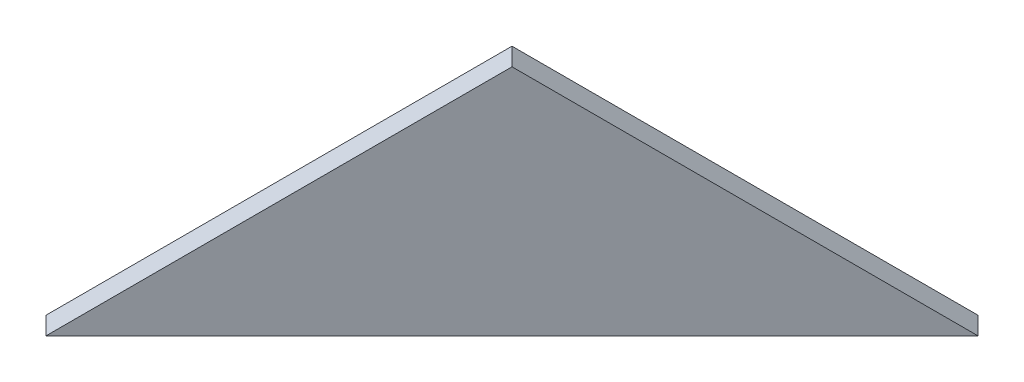
ISO-10303-21;
HEADER;
FILE_DESCRIPTION(('STEP AP214'),'2;1');
FILE_NAME('part.step','',(''),(''),'','','');
FILE_SCHEMA(('AUTOMOTIVE_DESIGN { 1 0 10303 214 1 1 1 1 }'));
ENDSEC;
DATA;
#1=APPLICATION_CONTEXT('core data for automotive mechanical design processes');
#2=APPLICATION_PROTOCOL_DEFINITION('international standard','automotive_design',2000,#1);
#3=PRODUCT_CONTEXT('',#1,'mechanical');
#4=PRODUCT('Part','Part','',(#3));
#5=PRODUCT_RELATED_PRODUCT_CATEGORY('part','',(#4));
#6=PRODUCT_DEFINITION_FORMATION('','',#4);
#7=PRODUCT_DEFINITION_CONTEXT('part definition',#1,'design');
#8=PRODUCT_DEFINITION('design','',#6,#7);
#9=PRODUCT_DEFINITION_SHAPE('','',#8);
#10=(LENGTH_UNIT() NAMED_UNIT(*) SI_UNIT(.MILLI.,.METRE.));
#11=(NAMED_UNIT(*) PLANE_ANGLE_UNIT() SI_UNIT($,.RADIAN.));
#12=(NAMED_UNIT(*) SI_UNIT($,.STERADIAN.) SOLID_ANGLE_UNIT());
#13=UNCERTAINTY_MEASURE_WITH_UNIT(LENGTH_MEASURE(1.E-05),#10,'distance_accuracy_value','');
#14=(GEOMETRIC_REPRESENTATION_CONTEXT(3) GLOBAL_UNCERTAINTY_ASSIGNED_CONTEXT((#13)) GLOBAL_UNIT_ASSIGNED_CONTEXT((#10,
#11,#12)) REPRESENTATION_CONTEXT('',''));
#15=CARTESIAN_POINT('',(0.,0.,0.));
#16=DIRECTION('',(0.,0.,1.));
#17=DIRECTION('',(1.,0.,0.));
#18=AXIS2_PLACEMENT_3D('',#15,#16,#17);
#19=CARTESIAN_POINT('',(106.993365854886,-111.164878,51.6882943771329));
#20=DIRECTION('',(0.408248290463862,0.816496580927727,-0.408248290463862));
#21=DIRECTION('',(-0.894427190999917,0.447213595499956,0.));
#22=AXIS2_PLACEMENT_3D('',#19,#20,#21);
#23=PLANE('',#22);
#24=DIRECTION('',(-0.577350269189627,0.577350269189624,0.577350269189627));
#25=VECTOR('',#24,1.);
#26=CARTESIAN_POINT('',(109.114686198445,-111.164878,53.8096147206926));
#27=LINE('',#26,#25);
#28=CARTESIAN_POINT('',(109.114686198445,-111.164878,53.8096147206926));
#29=VERTEX_POINT('',#28);
#30=CARTESIAN_POINT('',(81.4621504595688,-83.5123422611237,81.4621504595689));
#31=VERTEX_POINT('',#30);
#32=EDGE_CURVE('E89',#29,#31,#27,.T.);
#33=ORIENTED_EDGE('',*,*,#32,.F.);
#34=DIRECTION('',(0.707106781186547,0.,0.707106781186548));
#35=VECTOR('',#34,1.);
#36=CARTESIAN_POINT('',(106.993365854886,-111.164878,51.6882943771329));
#37=LINE('',#36,#35);
#38=CARTESIAN_POINT('',(106.993365854886,-111.164878,51.6882943771329));
#39=VERTEX_POINT('',#38);
#40=EDGE_CURVE('E11',#39,#29,#37,.T.);
#41=ORIENTED_EDGE('',*,*,#40,.F.);
#42=DIRECTION('',(-0.577350269189627,0.577350269189624,0.577350269189627));
#43=VECTOR('',#42,1.);
#44=CARTESIAN_POINT('',(106.993365854886,-111.164878,51.6882943771329));
#45=LINE('',#44,#43);
#46=CARTESIAN_POINT('',(79.3408301160091,-83.5123422611237,79.3408301160093));
#47=VERTEX_POINT('',#46);
#48=EDGE_CURVE('E79',#39,#47,#45,.T.);
#49=ORIENTED_EDGE('',*,*,#48,.T.);
#50=DIRECTION('',(0.707106781186547,0.,0.707106781186548));
#51=VECTOR('',#50,1.);
#52=CARTESIAN_POINT('',(79.3408301160091,-83.5123422611237,79.3408301160093));
#53=LINE('',#52,#51);
#54=EDGE_CURVE('E38',#47,#31,#53,.T.);
#55=ORIENTED_EDGE('',*,*,#54,.T.);
#56=EDGE_LOOP('',(#33,#41,#49,#55));
#57=FACE_BOUND('',#56,.T.);
#58=ADVANCED_FACE('F35',(#57),#23,.T.);
#59=CARTESIAN_POINT('',(51.6882943771329,-111.164878,106.993365854886));
#60=DIRECTION('',(0.,-1.,0.));
#61=DIRECTION('',(0.,0.,-1.));
#62=AXIS2_PLACEMENT_3D('',#59,#60,#61);
#63=PLANE('',#62);
#64=DIRECTION('',(0.707106781186547,0.,-0.707106781186547));
#65=VECTOR('',#64,1.);
#66=CARTESIAN_POINT('',(53.8096147206926,-111.164878,109.114686198445));
#67=LINE('',#66,#65);
#68=CARTESIAN_POINT('',(53.8096147206926,-111.164878,109.114686198445));
#69=VERTEX_POINT('',#68);
#70=EDGE_CURVE('E81',#69,#29,#67,.T.);
#71=ORIENTED_EDGE('',*,*,#70,.F.);
#72=DIRECTION('',(0.707106781186547,0.,0.707106781186548));
#73=VECTOR('',#72,1.);
#74=CARTESIAN_POINT('',(51.6882943771329,-111.164878,106.993365854886));
#75=LINE('',#74,#73);
#76=CARTESIAN_POINT('',(51.6882943771329,-111.164878,106.993365854886));
#77=VERTEX_POINT('',#76);
#78=EDGE_CURVE('E44',#77,#69,#75,.T.);
#79=ORIENTED_EDGE('',*,*,#78,.F.);
#80=DIRECTION('',(0.707106781186547,0.,-0.707106781186547));
#81=VECTOR('',#80,1.);
#82=CARTESIAN_POINT('',(51.6882943771329,-111.164878,106.993365854886));
#83=LINE('',#82,#81);
#84=EDGE_CURVE('E76',#77,#39,#83,.T.);
#85=ORIENTED_EDGE('',*,*,#84,.T.);
#86=ORIENTED_EDGE('',*,*,#40,.T.);
#87=EDGE_LOOP('',(#71,#79,#85,#86));
#88=FACE_BOUND('',#87,.T.);
#89=ADVANCED_FACE('F94',(#88),#63,.T.);
#90=CARTESIAN_POINT('',(79.3408301160091,-83.5123422611237,79.3408301160093));
#91=DIRECTION('',(-0.408248290463863,0.816496580927726,0.408248290463863));
#92=DIRECTION('',(-0.894427190999916,-0.447213595499958,0.));
#93=AXIS2_PLACEMENT_3D('',#90,#91,#92);
#94=PLANE('',#93);
#95=DIRECTION('',(-0.577350269189626,-0.577350269189626,0.577350269189626));
#96=VECTOR('',#95,1.);
#97=CARTESIAN_POINT('',(81.4621504595688,-83.5123422611237,81.4621504595689));
#98=LINE('',#97,#96);
#99=EDGE_CURVE('E74',#31,#69,#98,.T.);
#100=ORIENTED_EDGE('',*,*,#99,.F.);
#101=ORIENTED_EDGE('',*,*,#54,.F.);
#102=DIRECTION('',(-0.577350269189626,-0.577350269189626,0.577350269189626));
#103=VECTOR('',#102,1.);
#104=CARTESIAN_POINT('',(79.3408301160091,-83.5123422611237,79.3408301160093));
#105=LINE('',#104,#103);
#106=EDGE_CURVE('E72',#47,#77,#105,.T.);
#107=ORIENTED_EDGE('',*,*,#106,.T.);
#108=ORIENTED_EDGE('',*,*,#78,.T.);
#109=EDGE_LOOP('',(#100,#101,#107,#108));
#110=FACE_BOUND('',#109,.T.);
#111=ADVANCED_FACE('F71',(#110),#94,.T.);
#112=CARTESIAN_POINT('',(79.3408301160092,0.,79.3408301160092));
#113=DIRECTION('',(0.707106781186548,0.,0.707106781186548));
#114=DIRECTION('',(0.707106781186548,0.,-0.707106781186548));
#115=AXIS2_PLACEMENT_3D('',#112,#113,#114);
#116=PLANE('',#115);
#117=ORIENTED_EDGE('',*,*,#48,.F.);
#118=ORIENTED_EDGE('',*,*,#84,.F.);
#119=ORIENTED_EDGE('',*,*,#106,.F.);
#120=EDGE_LOOP('',(#117,#118,#119));
#121=FACE_BOUND('',#120,.T.);
#122=ADVANCED_FACE('F78',(#121),#116,.F.);
#123=CARTESIAN_POINT('',(81.4621504595689,0.,81.4621504595689));
#124=DIRECTION('',(0.707106781186548,0.,0.707106781186548));
#125=DIRECTION('',(0.707106781186548,0.,-0.707106781186548));
#126=AXIS2_PLACEMENT_3D('',#123,#124,#125);
#127=PLANE('',#126);
#128=ORIENTED_EDGE('',*,*,#32,.T.);
#129=ORIENTED_EDGE('',*,*,#99,.T.);
#130=ORIENTED_EDGE('',*,*,#70,.T.);
#131=EDGE_LOOP('',(#128,#129,#130));
#132=FACE_BOUND('',#131,.T.);
#133=ADVANCED_FACE('F93',(#132),#127,.T.);
#134=CLOSED_SHELL('',(#58,#89,#111,#122,#133));
#135=MANIFOLD_SOLID_BREP('B2',#134);
#136=ADVANCED_BREP_SHAPE_REPRESENTATION('',(#18,#135),#14);
#137=SHAPE_DEFINITION_REPRESENTATION(#9,#136);
ENDSEC;
END-ISO-10303-21;
